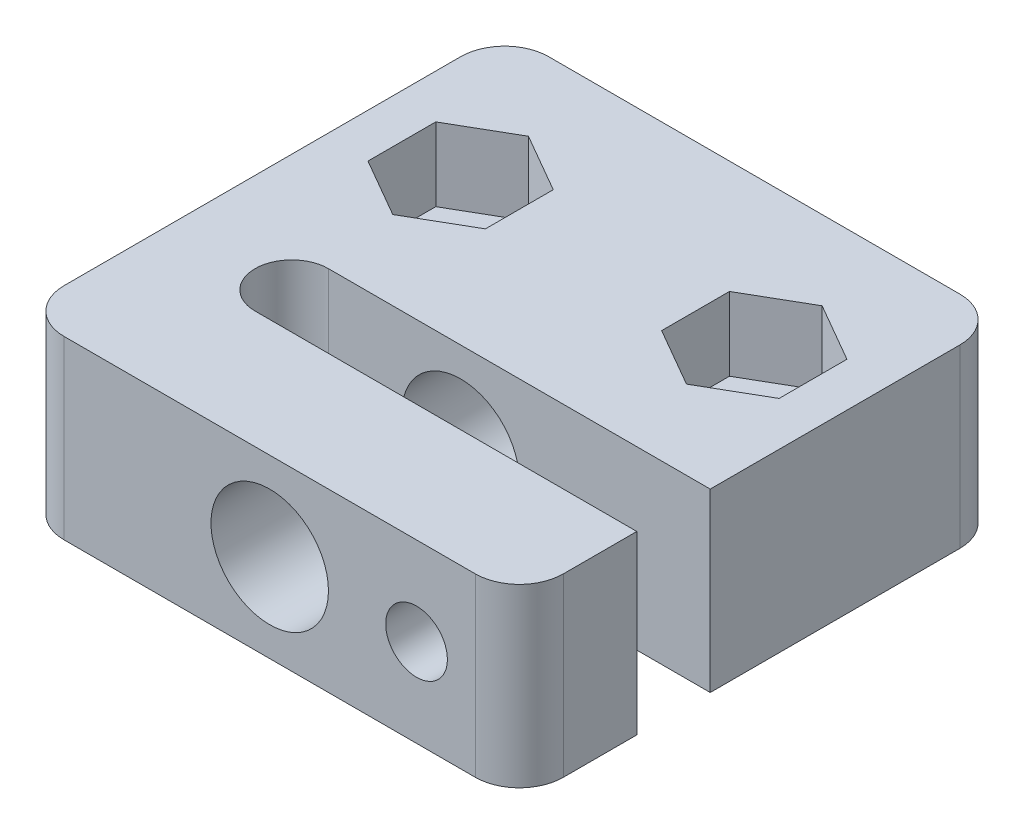
ISO-10303-21;
HEADER;
FILE_DESCRIPTION(('STEP AP214'),'2;1');
FILE_NAME('part.step','',(''),(''),'','','');
FILE_SCHEMA(('AUTOMOTIVE_DESIGN { 1 0 10303 214 1 1 1 1 }'));
ENDSEC;
DATA;
#1=APPLICATION_CONTEXT('core data for automotive mechanical design processes');
#2=APPLICATION_PROTOCOL_DEFINITION('international standard','automotive_design',2000,#1);
#3=PRODUCT_CONTEXT('',#1,'mechanical');
#4=PRODUCT('Part','Part','',(#3));
#5=PRODUCT_RELATED_PRODUCT_CATEGORY('part','',(#4));
#6=PRODUCT_DEFINITION_FORMATION('','',#4);
#7=PRODUCT_DEFINITION_CONTEXT('part definition',#1,'design');
#8=PRODUCT_DEFINITION('design','',#6,#7);
#9=PRODUCT_DEFINITION_SHAPE('','',#8);
#10=(LENGTH_UNIT() NAMED_UNIT(*) SI_UNIT(.MILLI.,.METRE.));
#11=(NAMED_UNIT(*) PLANE_ANGLE_UNIT() SI_UNIT($,.RADIAN.));
#12=(NAMED_UNIT(*) SI_UNIT($,.STERADIAN.) SOLID_ANGLE_UNIT());
#13=UNCERTAINTY_MEASURE_WITH_UNIT(LENGTH_MEASURE(1.E-05),#10,'distance_accuracy_value','');
#14=(GEOMETRIC_REPRESENTATION_CONTEXT(3) GLOBAL_UNCERTAINTY_ASSIGNED_CONTEXT((#13)) GLOBAL_UNIT_ASSIGNED_CONTEXT((#10,
#11,#12)) REPRESENTATION_CONTEXT('',''));
#15=CARTESIAN_POINT('',(0.,0.,0.));
#16=DIRECTION('',(0.,0.,1.));
#17=DIRECTION('',(1.,0.,0.));
#18=AXIS2_PLACEMENT_3D('',#15,#16,#17);
#19=CARTESIAN_POINT('',(17.,-6.,33.));
#20=DIRECTION('',(-1.,0.,0.));
#21=DIRECTION('',(0.,0.,1.));
#22=AXIS2_PLACEMENT_3D('',#19,#20,#21);
#23=PLANE('',#22);
#24=DIRECTION('',(0.,0.,-1.));
#25=VECTOR('',#24,1.);
#26=CARTESIAN_POINT('',(17.,6.,33.));
#27=LINE('',#26,#25);
#28=CARTESIAN_POINT('',(17.,6.,30.));
#29=VERTEX_POINT('',#28);
#30=CARTESIAN_POINT('',(17.,6.,25.));
#31=VERTEX_POINT('',#30);
#32=EDGE_CURVE('E247',#29,#31,#27,.T.);
#33=ORIENTED_EDGE('',*,*,#32,.F.);
#34=DIRECTION('',(0.,1.,0.));
#35=VECTOR('',#34,1.);
#36=CARTESIAN_POINT('',(17.,-6.,30.));
#37=LINE('',#36,#35);
#38=CARTESIAN_POINT('',(17.,-6.,30.));
#39=VERTEX_POINT('',#38);
#40=EDGE_CURVE('E11',#29,#39,#37,.F.);
#41=ORIENTED_EDGE('',*,*,#40,.T.);
#42=DIRECTION('',(0.,0.,-1.));
#43=VECTOR('',#42,1.);
#44=CARTESIAN_POINT('',(17.,-6.,33.));
#45=LINE('',#44,#43);
#46=CARTESIAN_POINT('',(17.,-6.,25.));
#47=VERTEX_POINT('',#46);
#48=EDGE_CURVE('E246',#39,#47,#45,.T.);
#49=ORIENTED_EDGE('',*,*,#48,.T.);
#50=DIRECTION('',(0.,1.,0.));
#51=VECTOR('',#50,1.);
#52=CARTESIAN_POINT('',(17.,-6.,25.));
#53=LINE('',#52,#51);
#54=EDGE_CURVE('E284',#47,#31,#53,.T.);
#55=ORIENTED_EDGE('',*,*,#54,.T.);
#56=EDGE_LOOP('',(#33,#41,#49,#55));
#57=FACE_BOUND('',#56,.T.);
#58=ADVANCED_FACE('F38',(#57),#23,.F.);
#59=CARTESIAN_POINT('',(0.,0.,0.));
#60=DIRECTION('',(0.,0.,1.));
#61=DIRECTION('',(1.,0.,0.));
#62=AXIS2_PLACEMENT_3D('',#59,#60,#61);
#63=CYLINDRICAL_SURFACE('',#62,4.);
#64=CARTESIAN_POINT('',(0.,0.,25.));
#65=DIRECTION('',(0.,0.,1.));
#66=DIRECTION('',(1.,0.,0.));
#67=AXIS2_PLACEMENT_3D('',#64,#65,#66);
#68=CIRCLE('',#67,4.);
#69=CARTESIAN_POINT('',(4.,0.,25.));
#70=VERTEX_POINT('',#69);
#71=EDGE_CURVE('E283',#70,#70,#68,.F.);
#72=ORIENTED_EDGE('',*,*,#71,.T.);
#73=EDGE_LOOP('',(#72));
#74=FACE_BOUND('',#73,.T.);
#75=CARTESIAN_POINT('',(0.,0.,33.));
#76=DIRECTION('',(0.,0.,1.));
#77=DIRECTION('',(1.,0.,0.));
#78=AXIS2_PLACEMENT_3D('',#75,#76,#77);
#79=CIRCLE('',#78,4.);
#80=CARTESIAN_POINT('',(4.,0.,33.));
#81=VERTEX_POINT('',#80);
#82=EDGE_CURVE('E261',#81,#81,#79,.T.);
#83=ORIENTED_EDGE('',*,*,#82,.T.);
#84=EDGE_LOOP('',(#83));
#85=FACE_BOUND('',#84,.T.);
#86=ADVANCED_FACE('F366',(#74,#85),#63,.F.);
#87=CARTESIAN_POINT('',(-10.,-6.00000000000001,10.));
#88=DIRECTION('',(0.,1.,0.));
#89=DIRECTION('',(-1.,0.,0.));
#90=AXIS2_PLACEMENT_3D('',#87,#88,#89);
#91=CYLINDRICAL_SURFACE('',#90,2.55);
#92=CARTESIAN_POINT('',(-10.,1.,10.));
#93=DIRECTION('',(0.,1.,0.));
#94=DIRECTION('',(0.,0.,1.));
#95=AXIS2_PLACEMENT_3D('',#92,#93,#94);
#96=CIRCLE('',#95,2.55);
#97=CARTESIAN_POINT('',(-10.,1.,12.55));
#98=VERTEX_POINT('',#97);
#99=EDGE_CURVE('E258',#98,#98,#96,.F.);
#100=ORIENTED_EDGE('',*,*,#99,.F.);
#101=EDGE_LOOP('',(#100));
#102=FACE_BOUND('',#101,.T.);
#103=CARTESIAN_POINT('',(-10.,-4.,10.));
#104=DIRECTION('',(0.,-1.,0.));
#105=DIRECTION('',(1.,0.,0.));
#106=AXIS2_PLACEMENT_3D('',#103,#104,#105);
#107=CIRCLE('',#106,2.55);
#108=CARTESIAN_POINT('',(-7.45,-4.,10.));
#109=VERTEX_POINT('',#108);
#110=EDGE_CURVE('E275',#109,#109,#107,.F.);
#111=ORIENTED_EDGE('',*,*,#110,.F.);
#112=EDGE_LOOP('',(#111));
#113=FACE_BOUND('',#112,.T.);
#114=ADVANCED_FACE('F372',(#102,#113),#91,.F.);
#115=CARTESIAN_POINT('',(10.,-6.00000000000001,10.));
#116=DIRECTION('',(0.,1.,0.));
#117=DIRECTION('',(-1.,0.,0.));
#118=AXIS2_PLACEMENT_3D('',#115,#116,#117);
#119=CYLINDRICAL_SURFACE('',#118,2.55);
#120=CARTESIAN_POINT('',(10.,1.,10.));
#121=DIRECTION('',(0.,-1.,0.));
#122=DIRECTION('',(1.,0.,0.));
#123=AXIS2_PLACEMENT_3D('',#120,#121,#122);
#124=CIRCLE('',#123,2.55);
#125=CARTESIAN_POINT('',(12.55,1.,10.));
#126=VERTEX_POINT('',#125);
#127=EDGE_CURVE('E263',#126,#126,#124,.F.);
#128=ORIENTED_EDGE('',*,*,#127,.T.);
#129=EDGE_LOOP('',(#128));
#130=FACE_BOUND('',#129,.T.);
#131=CARTESIAN_POINT('',(10.,-4.,10.));
#132=DIRECTION('',(0.,-1.,0.));
#133=DIRECTION('',(1.,0.,0.));
#134=AXIS2_PLACEMENT_3D('',#131,#132,#133);
#135=CIRCLE('',#134,2.55);
#136=CARTESIAN_POINT('',(12.55,-4.,10.));
#137=VERTEX_POINT('',#136);
#138=EDGE_CURVE('E269',#137,#137,#135,.F.);
#139=ORIENTED_EDGE('',*,*,#138,.F.);
#140=EDGE_LOOP('',(#139));
#141=FACE_BOUND('',#140,.T.);
#142=ADVANCED_FACE('F388',(#130,#141),#119,.F.);
#143=CARTESIAN_POINT('',(-17.,-6.,33.));
#144=DIRECTION('',(1.,0.,0.));
#145=DIRECTION('',(0.,0.,-1.));
#146=AXIS2_PLACEMENT_3D('',#143,#144,#145);
#147=PLANE('',#146);
#148=DIRECTION('',(0.,0.,-1.));
#149=VECTOR('',#148,1.);
#150=CARTESIAN_POINT('',(-17.,6.,33.));
#151=LINE('',#150,#149);
#152=CARTESIAN_POINT('',(-17.,6.,30.));
#153=VERTEX_POINT('',#152);
#154=CARTESIAN_POINT('',(-17.,6.,3.));
#155=VERTEX_POINT('',#154);
#156=EDGE_CURVE('E330',#153,#155,#151,.T.);
#157=ORIENTED_EDGE('',*,*,#156,.T.);
#158=DIRECTION('',(0.,-1.,0.));
#159=VECTOR('',#158,1.);
#160=CARTESIAN_POINT('',(-17.,-6.,3.));
#161=LINE('',#160,#159);
#162=CARTESIAN_POINT('',(-17.,-6.,3.));
#163=VERTEX_POINT('',#162);
#164=EDGE_CURVE('E289',#155,#163,#161,.T.);
#165=ORIENTED_EDGE('',*,*,#164,.T.);
#166=DIRECTION('',(0.,0.,-1.));
#167=VECTOR('',#166,1.);
#168=CARTESIAN_POINT('',(-17.,-6.,33.));
#169=LINE('',#168,#167);
#170=CARTESIAN_POINT('',(-17.,-6.,30.));
#171=VERTEX_POINT('',#170);
#172=EDGE_CURVE('E251',#171,#163,#169,.T.);
#173=ORIENTED_EDGE('',*,*,#172,.F.);
#174=DIRECTION('',(0.,-1.,0.));
#175=VECTOR('',#174,1.);
#176=CARTESIAN_POINT('',(-17.,6.,30.));
#177=LINE('',#176,#175);
#178=EDGE_CURVE('E257',#171,#153,#177,.F.);
#179=ORIENTED_EDGE('',*,*,#178,.T.);
#180=EDGE_LOOP('',(#157,#165,#173,#179));
#181=FACE_BOUND('',#180,.T.);
#182=ADVANCED_FACE('F355',(#181),#147,.F.);
#183=CARTESIAN_POINT('',(17.,-6.,33.));
#184=DIRECTION('',(0.,1.,0.));
#185=DIRECTION('',(-1.,0.,0.));
#186=AXIS2_PLACEMENT_3D('',#183,#184,#185);
#187=PLANE('',#186);
#188=CARTESIAN_POINT('',(-10.,-6.,10.));
#189=DIRECTION('',(0.,-1.,0.));
#190=DIRECTION('',(1.,0.,0.));
#191=AXIS2_PLACEMENT_3D('',#188,#189,#190);
#192=CIRCLE('',#191,4.5);
#193=CARTESIAN_POINT('',(-5.5,-6.,10.));
#194=VERTEX_POINT('',#193);
#195=EDGE_CURVE('E287',#194,#194,#192,.T.);
#196=ORIENTED_EDGE('',*,*,#195,.F.);
#197=EDGE_LOOP('',(#196));
#198=FACE_BOUND('',#197,.T.);
#199=CARTESIAN_POINT('',(10.,-6.,10.));
#200=DIRECTION('',(0.,-1.,0.));
#201=DIRECTION('',(1.,0.,0.));
#202=AXIS2_PLACEMENT_3D('',#199,#200,#201);
#203=CIRCLE('',#202,4.5);
#204=CARTESIAN_POINT('',(14.5,-6.,10.));
#205=VERTEX_POINT('',#204);
#206=EDGE_CURVE('E278',#205,#205,#203,.T.);
#207=ORIENTED_EDGE('',*,*,#206,.F.);
#208=EDGE_LOOP('',(#207));
#209=FACE_BOUND('',#208,.T.);
#210=ORIENTED_EDGE('',*,*,#172,.T.);
#211=CARTESIAN_POINT('',(-14.,-6.,3.));
#212=DIRECTION('',(0.,1.,0.));
#213=DIRECTION('',(-1.,0.,0.));
#214=AXIS2_PLACEMENT_3D('',#211,#212,#213);
#215=CIRCLE('',#214,3.);
#216=CARTESIAN_POINT('',(-14.,-6.,0.));
#217=VERTEX_POINT('',#216);
#218=EDGE_CURVE('E298',#163,#217,#215,.F.);
#219=ORIENTED_EDGE('',*,*,#218,.T.);
#220=DIRECTION('',(1.,0.,0.));
#221=VECTOR('',#220,1.);
#222=CARTESIAN_POINT('',(17.,-6.,0.));
#223=LINE('',#222,#221);
#224=CARTESIAN_POINT('',(14.,-6.,0.));
#225=VERTEX_POINT('',#224);
#226=EDGE_CURVE('E338',#217,#225,#223,.T.);
#227=ORIENTED_EDGE('',*,*,#226,.T.);
#228=CARTESIAN_POINT('',(14.,-6.,3.));
#229=DIRECTION('',(0.,1.,0.));
#230=DIRECTION('',(-1.,0.,0.));
#231=AXIS2_PLACEMENT_3D('',#228,#229,#230);
#232=CIRCLE('',#231,3.);
#233=CARTESIAN_POINT('',(17.,-6.,3.));
#234=VERTEX_POINT('',#233);
#235=EDGE_CURVE('E244',#225,#234,#232,.F.);
#236=ORIENTED_EDGE('',*,*,#235,.T.);
#237=CARTESIAN_POINT('',(17.,-6.,20.));
#238=VERTEX_POINT('',#237);
#239=EDGE_CURVE('E233',#238,#234,#45,.T.);
#240=ORIENTED_EDGE('',*,*,#239,.F.);
#241=DIRECTION('',(-1.,0.,0.));
#242=VECTOR('',#241,1.);
#243=CARTESIAN_POINT('',(17.,-6.,20.));
#244=LINE('',#243,#242);
#245=CARTESIAN_POINT('',(-9.,-6.00000000000001,20.));
#246=VERTEX_POINT('',#245);
#247=EDGE_CURVE('E213',#238,#246,#244,.T.);
#248=ORIENTED_EDGE('',*,*,#247,.T.);
#249=CARTESIAN_POINT('',(-9.,-6.00000000000001,22.5));
#250=DIRECTION('',(0.,1.,0.));
#251=DIRECTION('',(-1.,0.,0.));
#252=AXIS2_PLACEMENT_3D('',#249,#250,#251);
#253=CIRCLE('',#252,2.5);
#254=CARTESIAN_POINT('',(-9.,-6.00000000000001,25.));
#255=VERTEX_POINT('',#254);
#256=EDGE_CURVE('E225',#246,#255,#253,.T.);
#257=ORIENTED_EDGE('',*,*,#256,.T.);
#258=DIRECTION('',(1.,0.,0.));
#259=VECTOR('',#258,1.);
#260=CARTESIAN_POINT('',(17.,-6.,25.));
#261=LINE('',#260,#259);
#262=EDGE_CURVE('E238',#255,#47,#261,.T.);
#263=ORIENTED_EDGE('',*,*,#262,.T.);
#264=ORIENTED_EDGE('',*,*,#48,.F.);
#265=CARTESIAN_POINT('',(14.,-6.,30.));
#266=DIRECTION('',(0.,1.,0.));
#267=DIRECTION('',(-1.,0.,0.));
#268=AXIS2_PLACEMENT_3D('',#265,#266,#267);
#269=CIRCLE('',#268,3.);
#270=CARTESIAN_POINT('',(14.,-6.,33.));
#271=VERTEX_POINT('',#270);
#272=EDGE_CURVE('E295',#39,#271,#269,.F.);
#273=ORIENTED_EDGE('',*,*,#272,.T.);
#274=DIRECTION('',(1.,0.,0.));
#275=VECTOR('',#274,1.);
#276=CARTESIAN_POINT('',(17.,-6.,33.));
#277=LINE('',#276,#275);
#278=CARTESIAN_POINT('',(-14.,-6.,33.));
#279=VERTEX_POINT('',#278);
#280=EDGE_CURVE('E325',#279,#271,#277,.T.);
#281=ORIENTED_EDGE('',*,*,#280,.F.);
#282=CARTESIAN_POINT('',(-14.,-6.,30.));
#283=DIRECTION('',(0.,1.,0.));
#284=DIRECTION('',(-1.,0.,0.));
#285=AXIS2_PLACEMENT_3D('',#282,#283,#284);
#286=CIRCLE('',#285,3.);
#287=EDGE_CURVE('E293',#279,#171,#286,.F.);
#288=ORIENTED_EDGE('',*,*,#287,.T.);
#289=EDGE_LOOP('',(#210,#219,#227,#236,#240,#248,#257,#263,#264,#273,#281,#288));
#290=FACE_BOUND('',#289,.T.);
#291=ADVANCED_FACE('F241',(#198,#209,#290),#187,.F.);
#292=ORIENTED_EDGE('',*,*,#239,.T.);
#293=DIRECTION('',(0.,1.,0.));
#294=VECTOR('',#293,1.);
#295=CARTESIAN_POINT('',(17.,-6.,3.));
#296=LINE('',#295,#294);
#297=CARTESIAN_POINT('',(17.,6.,3.));
#298=VERTEX_POINT('',#297);
#299=EDGE_CURVE('E315',#234,#298,#296,.T.);
#300=ORIENTED_EDGE('',*,*,#299,.T.);
#301=CARTESIAN_POINT('',(17.,6.,20.));
#302=VERTEX_POINT('',#301);
#303=EDGE_CURVE('E236',#302,#298,#27,.T.);
#304=ORIENTED_EDGE('',*,*,#303,.F.);
#305=DIRECTION('',(0.,1.,0.));
#306=VECTOR('',#305,1.);
#307=CARTESIAN_POINT('',(17.,-6.,20.));
#308=LINE('',#307,#306);
#309=EDGE_CURVE('E218',#238,#302,#308,.T.);
#310=ORIENTED_EDGE('',*,*,#309,.F.);
#311=EDGE_LOOP('',(#292,#300,#304,#310));
#312=FACE_BOUND('',#311,.T.);
#313=ADVANCED_FACE('F231',(#312),#23,.F.);
#314=CARTESIAN_POINT('',(17.,6.,33.));
#315=DIRECTION('',(0.,-1.,0.));
#316=DIRECTION('',(1.,0.,0.));
#317=AXIS2_PLACEMENT_3D('',#314,#315,#316);
#318=PLANE('',#317);
#319=DIRECTION('',(0.866025403784438,0.,0.5));
#320=VECTOR('',#319,1.);
#321=CARTESIAN_POINT('',(10.,6.,14.618802153517));
#322=LINE('',#321,#320);
#323=CARTESIAN_POINT('',(6.00000000000001,6.,12.3094010767585));
#324=VERTEX_POINT('',#323);
#325=CARTESIAN_POINT('',(10.,6.,14.618802153517));
#326=VERTEX_POINT('',#325);
#327=EDGE_CURVE('E610',#324,#326,#322,.T.);
#328=ORIENTED_EDGE('',*,*,#327,.F.);
#329=DIRECTION('',(0.,0.,1.));
#330=VECTOR('',#329,1.);
#331=CARTESIAN_POINT('',(6.00000000000001,6.,12.3094010767585));
#332=LINE('',#331,#330);
#333=CARTESIAN_POINT('',(6.,6.,7.6905989232415));
#334=VERTEX_POINT('',#333);
#335=EDGE_CURVE('E273',#334,#324,#332,.T.);
#336=ORIENTED_EDGE('',*,*,#335,.F.);
#337=DIRECTION('',(-0.866025403784439,0.,0.5));
#338=VECTOR('',#337,1.);
#339=CARTESIAN_POINT('',(6.,6.,7.6905989232415));
#340=LINE('',#339,#338);
#341=CARTESIAN_POINT('',(10.,6.,5.381197846483));
#342=VERTEX_POINT('',#341);
#343=EDGE_CURVE('E589',#342,#334,#340,.T.);
#344=ORIENTED_EDGE('',*,*,#343,.F.);
#345=DIRECTION('',(-0.866025403784439,0.,-0.5));
#346=VECTOR('',#345,1.);
#347=CARTESIAN_POINT('',(10.,6.,5.381197846483));
#348=LINE('',#347,#346);
#349=CARTESIAN_POINT('',(14.,6.,7.6905989232415));
#350=VERTEX_POINT('',#349);
#351=EDGE_CURVE('E621',#350,#342,#348,.T.);
#352=ORIENTED_EDGE('',*,*,#351,.F.);
#353=DIRECTION('',(0.,0.,-1.));
#354=VECTOR('',#353,1.);
#355=CARTESIAN_POINT('',(14.,6.,7.6905989232415));
#356=LINE('',#355,#354);
#357=CARTESIAN_POINT('',(14.,6.,12.3094010767585));
#358=VERTEX_POINT('',#357);
#359=EDGE_CURVE('E618',#358,#350,#356,.T.);
#360=ORIENTED_EDGE('',*,*,#359,.F.);
#361=DIRECTION('',(0.866025403784439,0.,-0.5));
#362=VECTOR('',#361,1.);
#363=CARTESIAN_POINT('',(14.,6.,12.3094010767585));
#364=LINE('',#363,#362);
#365=EDGE_CURVE('E614',#326,#358,#364,.T.);
#366=ORIENTED_EDGE('',*,*,#365,.F.);
#367=EDGE_LOOP('',(#328,#336,#344,#352,#360,#366));
#368=FACE_BOUND('',#367,.T.);
#369=DIRECTION('',(-0.866025403784439,0.,0.5));
#370=VECTOR('',#369,1.);
#371=CARTESIAN_POINT('',(-10.,6.,5.381197846483));
#372=LINE('',#371,#370);
#373=CARTESIAN_POINT('',(-10.,6.,5.381197846483));
#374=VERTEX_POINT('',#373);
#375=CARTESIAN_POINT('',(-14.,6.,7.6905989232415));
#376=VERTEX_POINT('',#375);
#377=EDGE_CURVE('E405',#374,#376,#372,.T.);
#378=ORIENTED_EDGE('',*,*,#377,.F.);
#379=DIRECTION('',(-0.866025403784439,0.,-0.5));
#380=VECTOR('',#379,1.);
#381=CARTESIAN_POINT('',(-6.00000000000001,6.,7.6905989232415));
#382=LINE('',#381,#380);
#383=CARTESIAN_POINT('',(-6.00000000000001,6.,7.6905989232415));
#384=VERTEX_POINT('',#383);
#385=EDGE_CURVE('E267',#384,#374,#382,.T.);
#386=ORIENTED_EDGE('',*,*,#385,.F.);
#387=DIRECTION('',(0.,0.,-1.));
#388=VECTOR('',#387,1.);
#389=CARTESIAN_POINT('',(-6.00000000000001,6.,12.3094010767585));
#390=LINE('',#389,#388);
#391=CARTESIAN_POINT('',(-6.00000000000001,6.,12.3094010767585));
#392=VERTEX_POINT('',#391);
#393=EDGE_CURVE('E425',#392,#384,#390,.T.);
#394=ORIENTED_EDGE('',*,*,#393,.F.);
#395=DIRECTION('',(0.866025403784438,0.,-0.5));
#396=VECTOR('',#395,1.);
#397=CARTESIAN_POINT('',(-10.,6.,14.618802153517));
#398=LINE('',#397,#396);
#399=CARTESIAN_POINT('',(-10.,6.,14.618802153517));
#400=VERTEX_POINT('',#399);
#401=EDGE_CURVE('E422',#400,#392,#398,.T.);
#402=ORIENTED_EDGE('',*,*,#401,.F.);
#403=DIRECTION('',(0.866025403784439,0.,0.5));
#404=VECTOR('',#403,1.);
#405=CARTESIAN_POINT('',(-14.,6.,12.3094010767585));
#406=LINE('',#405,#404);
#407=CARTESIAN_POINT('',(-14.,6.,12.3094010767585));
#408=VERTEX_POINT('',#407);
#409=EDGE_CURVE('E419',#408,#400,#406,.T.);
#410=ORIENTED_EDGE('',*,*,#409,.F.);
#411=DIRECTION('',(0.,0.,1.));
#412=VECTOR('',#411,1.);
#413=CARTESIAN_POINT('',(-14.,6.,7.6905989232415));
#414=LINE('',#413,#412);
#415=EDGE_CURVE('E407',#376,#408,#414,.T.);
#416=ORIENTED_EDGE('',*,*,#415,.F.);
#417=EDGE_LOOP('',(#378,#386,#394,#402,#410,#416));
#418=FACE_BOUND('',#417,.T.);
#419=DIRECTION('',(-1.,0.,0.));
#420=VECTOR('',#419,1.);
#421=CARTESIAN_POINT('',(17.,6.,0.));
#422=LINE('',#421,#420);
#423=CARTESIAN_POINT('',(14.,6.,0.));
#424=VERTEX_POINT('',#423);
#425=CARTESIAN_POINT('',(-14.,6.,0.));
#426=VERTEX_POINT('',#425);
#427=EDGE_CURVE('E334',#424,#426,#422,.T.);
#428=ORIENTED_EDGE('',*,*,#427,.T.);
#429=CARTESIAN_POINT('',(-14.,6.,3.));
#430=DIRECTION('',(0.,-1.,0.));
#431=DIRECTION('',(1.,0.,0.));
#432=AXIS2_PLACEMENT_3D('',#429,#430,#431);
#433=CIRCLE('',#432,3.);
#434=EDGE_CURVE('E312',#426,#155,#433,.F.);
#435=ORIENTED_EDGE('',*,*,#434,.T.);
#436=ORIENTED_EDGE('',*,*,#156,.F.);
#437=CARTESIAN_POINT('',(-14.,6.,30.));
#438=DIRECTION('',(0.,-1.,0.));
#439=DIRECTION('',(1.,0.,0.));
#440=AXIS2_PLACEMENT_3D('',#437,#438,#439);
#441=CIRCLE('',#440,3.);
#442=CARTESIAN_POINT('',(-14.,6.,33.));
#443=VERTEX_POINT('',#442);
#444=EDGE_CURVE('E53',#153,#443,#441,.F.);
#445=ORIENTED_EDGE('',*,*,#444,.T.);
#446=DIRECTION('',(-1.,0.,0.));
#447=VECTOR('',#446,1.);
#448=CARTESIAN_POINT('',(17.,6.,33.));
#449=LINE('',#448,#447);
#450=CARTESIAN_POINT('',(14.,6.,33.));
#451=VERTEX_POINT('',#450);
#452=EDGE_CURVE('E322',#451,#443,#449,.T.);
#453=ORIENTED_EDGE('',*,*,#452,.F.);
#454=CARTESIAN_POINT('',(14.,6.,30.));
#455=DIRECTION('',(0.,-1.,0.));
#456=DIRECTION('',(1.,0.,0.));
#457=AXIS2_PLACEMENT_3D('',#454,#455,#456);
#458=CIRCLE('',#457,3.);
#459=EDGE_CURVE('E61',#451,#29,#458,.F.);
#460=ORIENTED_EDGE('',*,*,#459,.T.);
#461=ORIENTED_EDGE('',*,*,#32,.T.);
#462=DIRECTION('',(1.,0.,0.));
#463=VECTOR('',#462,1.);
#464=CARTESIAN_POINT('',(17.,6.,25.));
#465=LINE('',#464,#463);
#466=CARTESIAN_POINT('',(-9.,6.,25.));
#467=VERTEX_POINT('',#466);
#468=EDGE_CURVE('E226',#467,#31,#465,.T.);
#469=ORIENTED_EDGE('',*,*,#468,.F.);
#470=CARTESIAN_POINT('',(-9.,6.,22.5));
#471=DIRECTION('',(0.,1.,0.));
#472=DIRECTION('',(-1.,0.,0.));
#473=AXIS2_PLACEMENT_3D('',#470,#471,#472);
#474=CIRCLE('',#473,2.5);
#475=CARTESIAN_POINT('',(-9.,6.,20.));
#476=VERTEX_POINT('',#475);
#477=EDGE_CURVE('E564',#476,#467,#474,.T.);
#478=ORIENTED_EDGE('',*,*,#477,.F.);
#479=DIRECTION('',(-1.,0.,0.));
#480=VECTOR('',#479,1.);
#481=CARTESIAN_POINT('',(17.,6.,20.));
#482=LINE('',#481,#480);
#483=EDGE_CURVE('E401',#302,#476,#482,.T.);
#484=ORIENTED_EDGE('',*,*,#483,.F.);
#485=ORIENTED_EDGE('',*,*,#303,.T.);
#486=CARTESIAN_POINT('',(14.,6.,3.));
#487=DIRECTION('',(0.,-1.,0.));
#488=DIRECTION('',(1.,0.,0.));
#489=AXIS2_PLACEMENT_3D('',#486,#487,#488);
#490=CIRCLE('',#489,3.);
#491=EDGE_CURVE('E309',#298,#424,#490,.F.);
#492=ORIENTED_EDGE('',*,*,#491,.T.);
#493=EDGE_LOOP('',(#428,#435,#436,#445,#453,#460,#461,#469,#478,#484,#485,#492));
#494=FACE_BOUND('',#493,.T.);
#495=ADVANCED_FACE('F328',(#368,#418,#494),#318,.F.);
#496=CARTESIAN_POINT('',(0.,0.,33.));
#497=DIRECTION('',(0.,0.,1.));
#498=DIRECTION('',(1.,0.,0.));
#499=AXIS2_PLACEMENT_3D('',#496,#497,#498);
#500=PLANE('',#499);
#501=CARTESIAN_POINT('',(10.,0.,33.));
#502=DIRECTION('',(0.,0.,1.));
#503=DIRECTION('',(1.,0.,0.));
#504=AXIS2_PLACEMENT_3D('',#501,#502,#503);
#505=CIRCLE('',#504,2.09999999999999);
#506=CARTESIAN_POINT('',(12.1,0.,33.));
#507=VERTEX_POINT('',#506);
#508=EDGE_CURVE('E555',#507,#507,#505,.T.);
#509=ORIENTED_EDGE('',*,*,#508,.F.);
#510=EDGE_LOOP('',(#509));
#511=FACE_BOUND('',#510,.T.);
#512=ORIENTED_EDGE('',*,*,#82,.F.);
#513=EDGE_LOOP('',(#512));
#514=FACE_BOUND('',#513,.T.);
#515=ORIENTED_EDGE('',*,*,#280,.T.);
#516=DIRECTION('',(0.,1.,0.));
#517=VECTOR('',#516,1.);
#518=CARTESIAN_POINT('',(14.,6.,33.));
#519=LINE('',#518,#517);
#520=EDGE_CURVE('E46',#271,#451,#519,.T.);
#521=ORIENTED_EDGE('',*,*,#520,.T.);
#522=ORIENTED_EDGE('',*,*,#452,.T.);
#523=DIRECTION('',(0.,-1.,0.));
#524=VECTOR('',#523,1.);
#525=CARTESIAN_POINT('',(-14.,-6.,33.));
#526=LINE('',#525,#524);
#527=EDGE_CURVE('E317',#443,#279,#526,.T.);
#528=ORIENTED_EDGE('',*,*,#527,.T.);
#529=EDGE_LOOP('',(#515,#521,#522,#528));
#530=FACE_BOUND('',#529,.T.);
#531=ADVANCED_FACE('F321',(#511,#514,#530),#500,.T.);
#532=CARTESIAN_POINT('',(0.,0.,0.));
#533=DIRECTION('',(0.,0.,1.));
#534=DIRECTION('',(1.,0.,0.));
#535=AXIS2_PLACEMENT_3D('',#532,#533,#534);
#536=PLANE('',#535);
#537=CARTESIAN_POINT('',(0.,0.,0.));
#538=DIRECTION('',(0.,0.,1.));
#539=DIRECTION('',(1.,0.,0.));
#540=AXIS2_PLACEMENT_3D('',#537,#538,#539);
#541=CIRCLE('',#540,4.);
#542=CARTESIAN_POINT('',(4.,0.,0.));
#543=VERTEX_POINT('',#542);
#544=EDGE_CURVE('E341',#543,#543,#541,.T.);
#545=ORIENTED_EDGE('',*,*,#544,.T.);
#546=EDGE_LOOP('',(#545));
#547=FACE_BOUND('',#546,.T.);
#548=ORIENTED_EDGE('',*,*,#226,.F.);
#549=DIRECTION('',(0.,-1.,0.));
#550=VECTOR('',#549,1.);
#551=CARTESIAN_POINT('',(-14.,0.,0.));
#552=LINE('',#551,#550);
#553=EDGE_CURVE('E304',#217,#426,#552,.F.);
#554=ORIENTED_EDGE('',*,*,#553,.T.);
#555=ORIENTED_EDGE('',*,*,#427,.F.);
#556=DIRECTION('',(0.,1.,0.));
#557=VECTOR('',#556,1.);
#558=CARTESIAN_POINT('',(14.,0.,0.));
#559=LINE('',#558,#557);
#560=EDGE_CURVE('E301',#424,#225,#559,.F.);
#561=ORIENTED_EDGE('',*,*,#560,.T.);
#562=EDGE_LOOP('',(#548,#554,#555,#561));
#563=FACE_BOUND('',#562,.T.);
#564=ADVANCED_FACE('F447',(#547,#563),#536,.F.);
#565=CARTESIAN_POINT('',(0.,0.,20.));
#566=DIRECTION('',(0.,0.,-1.));
#567=DIRECTION('',(-1.,0.,0.));
#568=AXIS2_PLACEMENT_3D('',#565,#566,#567);
#569=CIRCLE('',#568,4.);
#570=CARTESIAN_POINT('',(-4.,0.,20.));
#571=VERTEX_POINT('',#570);
#572=EDGE_CURVE('E280',#571,#571,#569,.F.);
#573=ORIENTED_EDGE('',*,*,#572,.T.);
#574=EDGE_LOOP('',(#573));
#575=FACE_BOUND('',#574,.T.);
#576=ORIENTED_EDGE('',*,*,#544,.F.);
#577=EDGE_LOOP('',(#576));
#578=FACE_BOUND('',#577,.T.);
#579=ADVANCED_FACE('F375',(#575,#578),#63,.F.);
#580=CARTESIAN_POINT('',(0.,1.,0.));
#581=DIRECTION('',(0.,1.,0.));
#582=DIRECTION('',(0.,0.,1.));
#583=AXIS2_PLACEMENT_3D('',#580,#581,#582);
#584=PLANE('',#583);
#585=DIRECTION('',(-0.866025403784439,0.,-0.5));
#586=VECTOR('',#585,1.);
#587=CARTESIAN_POINT('',(-6.00000000000001,1.,7.6905989232415));
#588=LINE('',#587,#586);
#589=CARTESIAN_POINT('',(-6.00000000000001,1.,7.6905989232415));
#590=VERTEX_POINT('',#589);
#591=CARTESIAN_POINT('',(-10.,1.,5.381197846483));
#592=VERTEX_POINT('',#591);
#593=EDGE_CURVE('E428',#590,#592,#588,.T.);
#594=ORIENTED_EDGE('',*,*,#593,.T.);
#595=DIRECTION('',(-0.866025403784439,0.,0.5));
#596=VECTOR('',#595,1.);
#597=CARTESIAN_POINT('',(-10.,1.,5.381197846483));
#598=LINE('',#597,#596);
#599=CARTESIAN_POINT('',(-14.,1.,7.6905989232415));
#600=VERTEX_POINT('',#599);
#601=EDGE_CURVE('E643',#592,#600,#598,.T.);
#602=ORIENTED_EDGE('',*,*,#601,.T.);
#603=DIRECTION('',(0.,0.,1.));
#604=VECTOR('',#603,1.);
#605=CARTESIAN_POINT('',(-14.,1.,7.6905989232415));
#606=LINE('',#605,#604);
#607=CARTESIAN_POINT('',(-14.,1.,12.3094010767585));
#608=VERTEX_POINT('',#607);
#609=EDGE_CURVE('E647',#600,#608,#606,.T.);
#610=ORIENTED_EDGE('',*,*,#609,.T.);
#611=DIRECTION('',(0.866025403784439,0.,0.5));
#612=VECTOR('',#611,1.);
#613=CARTESIAN_POINT('',(-14.,1.,12.3094010767585));
#614=LINE('',#613,#612);
#615=CARTESIAN_POINT('',(-10.,1.,14.618802153517));
#616=VERTEX_POINT('',#615);
#617=EDGE_CURVE('E650',#608,#616,#614,.T.);
#618=ORIENTED_EDGE('',*,*,#617,.T.);
#619=DIRECTION('',(0.866025403784438,0.,-0.5));
#620=VECTOR('',#619,1.);
#621=CARTESIAN_POINT('',(-10.,1.,14.618802153517));
#622=LINE('',#621,#620);
#623=CARTESIAN_POINT('',(-6.00000000000001,1.,12.3094010767585));
#624=VERTEX_POINT('',#623);
#625=EDGE_CURVE('E652',#616,#624,#622,.T.);
#626=ORIENTED_EDGE('',*,*,#625,.T.);
#627=DIRECTION('',(0.,0.,-1.));
#628=VECTOR('',#627,1.);
#629=CARTESIAN_POINT('',(-6.00000000000001,1.,12.3094010767585));
#630=LINE('',#629,#628);
#631=EDGE_CURVE('E414',#624,#590,#630,.T.);
#632=ORIENTED_EDGE('',*,*,#631,.T.);
#633=EDGE_LOOP('',(#594,#602,#610,#618,#626,#632));
#634=FACE_BOUND('',#633,.T.);
#635=ORIENTED_EDGE('',*,*,#99,.T.);
#636=EDGE_LOOP('',(#635));
#637=FACE_BOUND('',#636,.T.);
#638=ADVANCED_FACE('F458',(#634,#637),#584,.T.);
#639=CARTESIAN_POINT('',(-6.00000000000001,1.,7.6905989232415));
#640=DIRECTION('',(0.5,0.,-0.866025403784439));
#641=DIRECTION('',(-0.866025403784439,0.,-0.5));
#642=AXIS2_PLACEMENT_3D('',#639,#640,#641);
#643=PLANE('',#642);
#644=ORIENTED_EDGE('',*,*,#385,.T.);
#645=DIRECTION('',(0.,1.,0.));
#646=VECTOR('',#645,1.);
#647=CARTESIAN_POINT('',(-10.,1.,5.381197846483));
#648=LINE('',#647,#646);
#649=EDGE_CURVE('E438',#592,#374,#648,.T.);
#650=ORIENTED_EDGE('',*,*,#649,.F.);
#651=ORIENTED_EDGE('',*,*,#593,.F.);
#652=DIRECTION('',(0.,1.,0.));
#653=VECTOR('',#652,1.);
#654=CARTESIAN_POINT('',(-6.00000000000001,1.,7.6905989232415));
#655=LINE('',#654,#653);
#656=EDGE_CURVE('E262',#590,#384,#655,.T.);
#657=ORIENTED_EDGE('',*,*,#656,.T.);
#658=EDGE_LOOP('',(#644,#650,#651,#657));
#659=FACE_BOUND('',#658,.T.);
#660=ADVANCED_FACE('F466',(#659),#643,.F.);
#661=CARTESIAN_POINT('',(-6.00000000000001,1.,12.3094010767585));
#662=DIRECTION('',(1.,0.,0.));
#663=DIRECTION('',(0.,0.,-1.));
#664=AXIS2_PLACEMENT_3D('',#661,#662,#663);
#665=PLANE('',#664);
#666=ORIENTED_EDGE('',*,*,#393,.T.);
#667=ORIENTED_EDGE('',*,*,#656,.F.);
#668=ORIENTED_EDGE('',*,*,#631,.F.);
#669=DIRECTION('',(0.,1.,0.));
#670=VECTOR('',#669,1.);
#671=CARTESIAN_POINT('',(-6.00000000000001,1.,12.3094010767585));
#672=LINE('',#671,#670);
#673=EDGE_CURVE('E430',#624,#392,#672,.T.);
#674=ORIENTED_EDGE('',*,*,#673,.T.);
#675=EDGE_LOOP('',(#666,#667,#668,#674));
#676=FACE_BOUND('',#675,.T.);
#677=ADVANCED_FACE('F469',(#676),#665,.F.);
#678=CARTESIAN_POINT('',(-10.,1.,14.618802153517));
#679=DIRECTION('',(0.5,0.,0.866025403784438));
#680=DIRECTION('',(0.866025403784438,0.,-0.5));
#681=AXIS2_PLACEMENT_3D('',#678,#679,#680);
#682=PLANE('',#681);
#683=ORIENTED_EDGE('',*,*,#401,.T.);
#684=ORIENTED_EDGE('',*,*,#673,.F.);
#685=ORIENTED_EDGE('',*,*,#625,.F.);
#686=DIRECTION('',(0.,1.,0.));
#687=VECTOR('',#686,1.);
#688=CARTESIAN_POINT('',(-10.,1.,14.618802153517));
#689=LINE('',#688,#687);
#690=EDGE_CURVE('E432',#616,#400,#689,.T.);
#691=ORIENTED_EDGE('',*,*,#690,.T.);
#692=EDGE_LOOP('',(#683,#684,#685,#691));
#693=FACE_BOUND('',#692,.T.);
#694=ADVANCED_FACE('F482',(#693),#682,.F.);
#695=CARTESIAN_POINT('',(-14.,1.,12.3094010767585));
#696=DIRECTION('',(-0.5,0.,0.866025403784438));
#697=DIRECTION('',(0.866025403784439,0.,0.5));
#698=AXIS2_PLACEMENT_3D('',#695,#696,#697);
#699=PLANE('',#698);
#700=ORIENTED_EDGE('',*,*,#409,.T.);
#701=ORIENTED_EDGE('',*,*,#690,.F.);
#702=ORIENTED_EDGE('',*,*,#617,.F.);
#703=DIRECTION('',(0.,1.,0.));
#704=VECTOR('',#703,1.);
#705=CARTESIAN_POINT('',(-14.,1.,12.3094010767585));
#706=LINE('',#705,#704);
#707=EDGE_CURVE('E434',#608,#408,#706,.T.);
#708=ORIENTED_EDGE('',*,*,#707,.T.);
#709=EDGE_LOOP('',(#700,#701,#702,#708));
#710=FACE_BOUND('',#709,.T.);
#711=ADVANCED_FACE('F478',(#710),#699,.F.);
#712=CARTESIAN_POINT('',(-14.,1.,7.6905989232415));
#713=DIRECTION('',(-1.,0.,0.));
#714=DIRECTION('',(0.,-1.,0.));
#715=AXIS2_PLACEMENT_3D('',#712,#713,#714);
#716=PLANE('',#715);
#717=ORIENTED_EDGE('',*,*,#415,.T.);
#718=ORIENTED_EDGE('',*,*,#707,.F.);
#719=ORIENTED_EDGE('',*,*,#609,.F.);
#720=DIRECTION('',(0.,1.,0.));
#721=VECTOR('',#720,1.);
#722=CARTESIAN_POINT('',(-14.,1.,7.6905989232415));
#723=LINE('',#722,#721);
#724=EDGE_CURVE('E436',#600,#376,#723,.T.);
#725=ORIENTED_EDGE('',*,*,#724,.T.);
#726=EDGE_LOOP('',(#717,#718,#719,#725));
#727=FACE_BOUND('',#726,.T.);
#728=ADVANCED_FACE('F474',(#727),#716,.F.);
#729=CARTESIAN_POINT('',(-10.,1.,5.381197846483));
#730=DIRECTION('',(-0.5,0.,-0.866025403784439));
#731=DIRECTION('',(-0.866025403784439,0.,0.5));
#732=AXIS2_PLACEMENT_3D('',#729,#730,#731);
#733=PLANE('',#732);
#734=ORIENTED_EDGE('',*,*,#377,.T.);
#735=ORIENTED_EDGE('',*,*,#724,.F.);
#736=ORIENTED_EDGE('',*,*,#601,.F.);
#737=ORIENTED_EDGE('',*,*,#649,.T.);
#738=EDGE_LOOP('',(#734,#735,#736,#737));
#739=FACE_BOUND('',#738,.T.);
#740=ADVANCED_FACE('F470',(#739),#733,.F.);
#741=CARTESIAN_POINT('',(0.,1.,0.));
#742=DIRECTION('',(0.,-1.,0.));
#743=DIRECTION('',(1.,0.,0.));
#744=AXIS2_PLACEMENT_3D('',#741,#742,#743);
#745=PLANE('',#744);
#746=DIRECTION('',(0.,0.,1.));
#747=VECTOR('',#746,1.);
#748=CARTESIAN_POINT('',(6.00000000000001,1.,12.3094010767585));
#749=LINE('',#748,#747);
#750=CARTESIAN_POINT('',(6.00000000000001,1.,7.6905989232415));
#751=VERTEX_POINT('',#750);
#752=CARTESIAN_POINT('',(6.00000000000001,1.,12.3094010767585));
#753=VERTEX_POINT('',#752);
#754=EDGE_CURVE('E584',#751,#753,#749,.T.);
#755=ORIENTED_EDGE('',*,*,#754,.T.);
#756=DIRECTION('',(0.866025403784438,0.,0.5));
#757=VECTOR('',#756,1.);
#758=CARTESIAN_POINT('',(10.,1.,14.618802153517));
#759=LINE('',#758,#757);
#760=CARTESIAN_POINT('',(10.,1.,14.618802153517));
#761=VERTEX_POINT('',#760);
#762=EDGE_CURVE('E588',#753,#761,#759,.T.);
#763=ORIENTED_EDGE('',*,*,#762,.T.);
#764=DIRECTION('',(0.866025403784439,0.,-0.5));
#765=VECTOR('',#764,1.);
#766=CARTESIAN_POINT('',(14.,1.,12.3094010767585));
#767=LINE('',#766,#765);
#768=CARTESIAN_POINT('',(14.,1.,12.3094010767585));
#769=VERTEX_POINT('',#768);
#770=EDGE_CURVE('E593',#761,#769,#767,.T.);
#771=ORIENTED_EDGE('',*,*,#770,.T.);
#772=DIRECTION('',(0.,0.,-1.));
#773=VECTOR('',#772,1.);
#774=CARTESIAN_POINT('',(14.,1.,7.6905989232415));
#775=LINE('',#774,#773);
#776=CARTESIAN_POINT('',(14.,1.,7.6905989232415));
#777=VERTEX_POINT('',#776);
#778=EDGE_CURVE('E597',#769,#777,#775,.T.);
#779=ORIENTED_EDGE('',*,*,#778,.T.);
#780=DIRECTION('',(-0.866025403784439,0.,-0.5));
#781=VECTOR('',#780,1.);
#782=CARTESIAN_POINT('',(10.,1.,5.381197846483));
#783=LINE('',#782,#781);
#784=CARTESIAN_POINT('',(10.,1.,5.381197846483));
#785=VERTEX_POINT('',#784);
#786=EDGE_CURVE('E600',#777,#785,#783,.T.);
#787=ORIENTED_EDGE('',*,*,#786,.T.);
#788=DIRECTION('',(-0.866025403784439,0.,0.5));
#789=VECTOR('',#788,1.);
#790=CARTESIAN_POINT('',(6.00000000000001,1.,7.6905989232415));
#791=LINE('',#790,#789);
#792=EDGE_CURVE('E603',#785,#751,#791,.T.);
#793=ORIENTED_EDGE('',*,*,#792,.T.);
#794=EDGE_LOOP('',(#755,#763,#771,#779,#787,#793));
#795=FACE_BOUND('',#794,.T.);
#796=ORIENTED_EDGE('',*,*,#127,.F.);
#797=EDGE_LOOP('',(#796));
#798=FACE_BOUND('',#797,.T.);
#799=ADVANCED_FACE('F473',(#795,#798),#745,.F.);
#800=CARTESIAN_POINT('',(6.00000000000001,1.,12.3094010767585));
#801=DIRECTION('',(-1.,0.,0.));
#802=DIRECTION('',(0.,0.,1.));
#803=AXIS2_PLACEMENT_3D('',#800,#801,#802);
#804=PLANE('',#803);
#805=ORIENTED_EDGE('',*,*,#335,.T.);
#806=DIRECTION('',(0.,1.,0.));
#807=VECTOR('',#806,1.);
#808=CARTESIAN_POINT('',(6.00000000000001,1.,12.3094010767585));
#809=LINE('',#808,#807);
#810=EDGE_CURVE('E607',#753,#324,#809,.T.);
#811=ORIENTED_EDGE('',*,*,#810,.F.);
#812=ORIENTED_EDGE('',*,*,#754,.F.);
#813=DIRECTION('',(0.,1.,0.));
#814=VECTOR('',#813,1.);
#815=CARTESIAN_POINT('',(6.00000000000001,1.,7.6905989232415));
#816=LINE('',#815,#814);
#817=EDGE_CURVE('E268',#751,#334,#816,.T.);
#818=ORIENTED_EDGE('',*,*,#817,.T.);
#819=EDGE_LOOP('',(#805,#811,#812,#818));
#820=FACE_BOUND('',#819,.T.);
#821=ADVANCED_FACE('F493',(#820),#804,.F.);
#822=CARTESIAN_POINT('',(6.00000000000001,1.,7.6905989232415));
#823=DIRECTION('',(-0.5,0.,-0.866025403784439));
#824=DIRECTION('',(-0.866025403784439,0.,0.5));
#825=AXIS2_PLACEMENT_3D('',#822,#823,#824);
#826=PLANE('',#825);
#827=ORIENTED_EDGE('',*,*,#343,.T.);
#828=ORIENTED_EDGE('',*,*,#817,.F.);
#829=ORIENTED_EDGE('',*,*,#792,.F.);
#830=DIRECTION('',(0.,1.,0.));
#831=VECTOR('',#830,1.);
#832=CARTESIAN_POINT('',(10.,1.,5.381197846483));
#833=LINE('',#832,#831);
#834=EDGE_CURVE('E628',#785,#342,#833,.T.);
#835=ORIENTED_EDGE('',*,*,#834,.T.);
#836=EDGE_LOOP('',(#827,#828,#829,#835));
#837=FACE_BOUND('',#836,.T.);
#838=ADVANCED_FACE('F496',(#837),#826,.F.);
#839=CARTESIAN_POINT('',(10.,1.,5.381197846483));
#840=DIRECTION('',(0.5,0.,-0.866025403784439));
#841=DIRECTION('',(-0.866025403784439,0.,-0.5));
#842=AXIS2_PLACEMENT_3D('',#839,#840,#841);
#843=PLANE('',#842);
#844=ORIENTED_EDGE('',*,*,#351,.T.);
#845=ORIENTED_EDGE('',*,*,#834,.F.);
#846=ORIENTED_EDGE('',*,*,#786,.F.);
#847=DIRECTION('',(0.,1.,0.));
#848=VECTOR('',#847,1.);
#849=CARTESIAN_POINT('',(14.,1.,7.6905989232415));
#850=LINE('',#849,#848);
#851=EDGE_CURVE('E630',#777,#350,#850,.T.);
#852=ORIENTED_EDGE('',*,*,#851,.T.);
#853=EDGE_LOOP('',(#844,#845,#846,#852));
#854=FACE_BOUND('',#853,.T.);
#855=ADVANCED_FACE('F510',(#854),#843,.F.);
#856=CARTESIAN_POINT('',(14.,1.,7.6905989232415));
#857=DIRECTION('',(1.,0.,0.));
#858=DIRECTION('',(0.,1.,0.));
#859=AXIS2_PLACEMENT_3D('',#856,#857,#858);
#860=PLANE('',#859);
#861=ORIENTED_EDGE('',*,*,#359,.T.);
#862=ORIENTED_EDGE('',*,*,#851,.F.);
#863=ORIENTED_EDGE('',*,*,#778,.F.);
#864=DIRECTION('',(0.,1.,0.));
#865=VECTOR('',#864,1.);
#866=CARTESIAN_POINT('',(14.,1.,12.3094010767585));
#867=LINE('',#866,#865);
#868=EDGE_CURVE('E632',#769,#358,#867,.T.);
#869=ORIENTED_EDGE('',*,*,#868,.T.);
#870=EDGE_LOOP('',(#861,#862,#863,#869));
#871=FACE_BOUND('',#870,.T.);
#872=ADVANCED_FACE('F506',(#871),#860,.F.);
#873=CARTESIAN_POINT('',(14.,1.,12.3094010767585));
#874=DIRECTION('',(0.5,0.,0.866025403784438));
#875=DIRECTION('',(0.866025403784439,0.,-0.5));
#876=AXIS2_PLACEMENT_3D('',#873,#874,#875);
#877=PLANE('',#876);
#878=ORIENTED_EDGE('',*,*,#365,.T.);
#879=ORIENTED_EDGE('',*,*,#868,.F.);
#880=ORIENTED_EDGE('',*,*,#770,.F.);
#881=DIRECTION('',(0.,1.,0.));
#882=VECTOR('',#881,1.);
#883=CARTESIAN_POINT('',(10.,1.,14.618802153517));
#884=LINE('',#883,#882);
#885=EDGE_CURVE('E634',#761,#326,#884,.T.);
#886=ORIENTED_EDGE('',*,*,#885,.T.);
#887=EDGE_LOOP('',(#878,#879,#880,#886));
#888=FACE_BOUND('',#887,.T.);
#889=ADVANCED_FACE('F502',(#888),#877,.F.);
#890=CARTESIAN_POINT('',(10.,1.,14.618802153517));
#891=DIRECTION('',(-0.5,0.,0.866025403784438));
#892=DIRECTION('',(0.866025403784438,0.,0.5));
#893=AXIS2_PLACEMENT_3D('',#890,#891,#892);
#894=PLANE('',#893);
#895=ORIENTED_EDGE('',*,*,#327,.T.);
#896=ORIENTED_EDGE('',*,*,#885,.F.);
#897=ORIENTED_EDGE('',*,*,#762,.F.);
#898=ORIENTED_EDGE('',*,*,#810,.T.);
#899=EDGE_LOOP('',(#895,#896,#897,#898));
#900=FACE_BOUND('',#899,.T.);
#901=ADVANCED_FACE('F498',(#900),#894,.F.);
#902=CARTESIAN_POINT('',(10.,-4.,10.));
#903=DIRECTION('',(0.,-1.,0.));
#904=DIRECTION('',(1.,0.,0.));
#905=AXIS2_PLACEMENT_3D('',#902,#903,#904);
#906=PLANE('',#905);
#907=CARTESIAN_POINT('',(10.,-4.,10.));
#908=DIRECTION('',(0.,-1.,0.));
#909=DIRECTION('',(1.,0.,0.));
#910=AXIS2_PLACEMENT_3D('',#907,#908,#909);
#911=CIRCLE('',#910,4.5);
#912=CARTESIAN_POINT('',(14.5,-4.,10.));
#913=VERTEX_POINT('',#912);
#914=EDGE_CURVE('E274',#913,#913,#911,.T.);
#915=ORIENTED_EDGE('',*,*,#914,.T.);
#916=EDGE_LOOP('',(#915));
#917=FACE_BOUND('',#916,.T.);
#918=ORIENTED_EDGE('',*,*,#138,.T.);
#919=EDGE_LOOP('',(#918));
#920=FACE_BOUND('',#919,.T.);
#921=ADVANCED_FACE('F501',(#917,#920),#906,.T.);
#922=CARTESIAN_POINT('',(10.,-4.,10.));
#923=DIRECTION('',(0.,-1.,0.));
#924=DIRECTION('',(1.,0.,0.));
#925=AXIS2_PLACEMENT_3D('',#922,#923,#924);
#926=CYLINDRICAL_SURFACE('',#925,4.5);
#927=ORIENTED_EDGE('',*,*,#914,.F.);
#928=EDGE_LOOP('',(#927));
#929=FACE_BOUND('',#928,.T.);
#930=ORIENTED_EDGE('',*,*,#206,.T.);
#931=EDGE_LOOP('',(#930));
#932=FACE_BOUND('',#931,.T.);
#933=ADVANCED_FACE('F521',(#929,#932),#926,.F.);
#934=CARTESIAN_POINT('',(-10.,-4.,10.));
#935=DIRECTION('',(0.,-1.,0.));
#936=DIRECTION('',(1.,0.,0.));
#937=AXIS2_PLACEMENT_3D('',#934,#935,#936);
#938=PLANE('',#937);
#939=CARTESIAN_POINT('',(-10.,-4.,10.));
#940=DIRECTION('',(0.,-1.,0.));
#941=DIRECTION('',(1.,0.,0.));
#942=AXIS2_PLACEMENT_3D('',#939,#940,#941);
#943=CIRCLE('',#942,4.5);
#944=CARTESIAN_POINT('',(-5.5,-4.,10.));
#945=VERTEX_POINT('',#944);
#946=EDGE_CURVE('E279',#945,#945,#943,.T.);
#947=ORIENTED_EDGE('',*,*,#946,.T.);
#948=EDGE_LOOP('',(#947));
#949=FACE_BOUND('',#948,.T.);
#950=ORIENTED_EDGE('',*,*,#110,.T.);
#951=EDGE_LOOP('',(#950));
#952=FACE_BOUND('',#951,.T.);
#953=ADVANCED_FACE('F524',(#949,#952),#938,.T.);
#954=CARTESIAN_POINT('',(-10.,-4.,10.));
#955=DIRECTION('',(0.,-1.,0.));
#956=DIRECTION('',(1.,0.,0.));
#957=AXIS2_PLACEMENT_3D('',#954,#955,#956);
#958=CYLINDRICAL_SURFACE('',#957,4.5);
#959=ORIENTED_EDGE('',*,*,#946,.F.);
#960=EDGE_LOOP('',(#959));
#961=FACE_BOUND('',#960,.T.);
#962=ORIENTED_EDGE('',*,*,#195,.T.);
#963=EDGE_LOOP('',(#962));
#964=FACE_BOUND('',#963,.T.);
#965=ADVANCED_FACE('F529',(#961,#964),#958,.F.);
#966=CARTESIAN_POINT('',(17.,-6.,25.));
#967=DIRECTION('',(0.,0.,1.));
#968=DIRECTION('',(1.,0.,0.));
#969=AXIS2_PLACEMENT_3D('',#966,#967,#968);
#970=PLANE('',#969);
#971=CARTESIAN_POINT('',(10.,0.,25.));
#972=DIRECTION('',(0.,0.,1.));
#973=DIRECTION('',(1.,0.,0.));
#974=AXIS2_PLACEMENT_3D('',#971,#972,#973);
#975=CIRCLE('',#974,2.09999999999999);
#976=CARTESIAN_POINT('',(12.1,0.,25.));
#977=VERTEX_POINT('',#976);
#978=EDGE_CURVE('E553',#977,#977,#975,.T.);
#979=ORIENTED_EDGE('',*,*,#978,.T.);
#980=EDGE_LOOP('',(#979));
#981=FACE_BOUND('',#980,.T.);
#982=ORIENTED_EDGE('',*,*,#468,.T.);
#983=ORIENTED_EDGE('',*,*,#54,.F.);
#984=ORIENTED_EDGE('',*,*,#262,.F.);
#985=DIRECTION('',(0.,1.,0.));
#986=VECTOR('',#985,1.);
#987=CARTESIAN_POINT('',(-9.,-6.00000000000001,25.));
#988=LINE('',#987,#986);
#989=EDGE_CURVE('E572',#255,#467,#988,.T.);
#990=ORIENTED_EDGE('',*,*,#989,.T.);
#991=EDGE_LOOP('',(#982,#983,#984,#990));
#992=FACE_BOUND('',#991,.T.);
#993=ORIENTED_EDGE('',*,*,#71,.F.);
#994=EDGE_LOOP('',(#993));
#995=FACE_BOUND('',#994,.T.);
#996=ADVANCED_FACE('F532',(#981,#992,#995),#970,.F.);
#997=CARTESIAN_POINT('',(17.,-6.,20.));
#998=DIRECTION('',(0.,0.,-1.));
#999=DIRECTION('',(-1.,0.,0.));
#1000=AXIS2_PLACEMENT_3D('',#997,#998,#999);
#1001=PLANE('',#1000);
#1002=ORIENTED_EDGE('',*,*,#483,.T.);
#1003=DIRECTION('',(0.,1.,0.));
#1004=VECTOR('',#1003,1.);
#1005=CARTESIAN_POINT('',(-9.,-6.00000000000001,20.));
#1006=LINE('',#1005,#1004);
#1007=EDGE_CURVE('E220',#246,#476,#1006,.T.);
#1008=ORIENTED_EDGE('',*,*,#1007,.F.);
#1009=ORIENTED_EDGE('',*,*,#247,.F.);
#1010=ORIENTED_EDGE('',*,*,#309,.T.);
#1011=EDGE_LOOP('',(#1002,#1008,#1009,#1010));
#1012=FACE_BOUND('',#1011,.T.);
#1013=ORIENTED_EDGE('',*,*,#572,.F.);
#1014=EDGE_LOOP('',(#1013));
#1015=FACE_BOUND('',#1014,.T.);
#1016=ADVANCED_FACE('F216',(#1012,#1015),#1001,.F.);
#1017=CARTESIAN_POINT('',(-9.,-6.00000000000001,22.5));
#1018=DIRECTION('',(0.,1.,0.));
#1019=DIRECTION('',(-1.,0.,0.));
#1020=AXIS2_PLACEMENT_3D('',#1017,#1018,#1019);
#1021=CYLINDRICAL_SURFACE('',#1020,2.5);
#1022=ORIENTED_EDGE('',*,*,#477,.T.);
#1023=ORIENTED_EDGE('',*,*,#989,.F.);
#1024=ORIENTED_EDGE('',*,*,#256,.F.);
#1025=ORIENTED_EDGE('',*,*,#1007,.T.);
#1026=EDGE_LOOP('',(#1022,#1023,#1024,#1025));
#1027=FACE_BOUND('',#1026,.T.);
#1028=ADVANCED_FACE('F539',(#1027),#1021,.F.);
#1029=CARTESIAN_POINT('',(10.,0.,33.));
#1030=DIRECTION('',(0.,0.,1.));
#1031=DIRECTION('',(1.,0.,0.));
#1032=AXIS2_PLACEMENT_3D('',#1029,#1030,#1031);
#1033=CYLINDRICAL_SURFACE('',#1032,2.09999999999999);
#1034=ORIENTED_EDGE('',*,*,#978,.F.);
#1035=EDGE_LOOP('',(#1034));
#1036=FACE_BOUND('',#1035,.T.);
#1037=ORIENTED_EDGE('',*,*,#508,.T.);
#1038=EDGE_LOOP('',(#1037));
#1039=FACE_BOUND('',#1038,.T.);
#1040=ADVANCED_FACE('F395',(#1036,#1039),#1033,.F.);
#1041=CARTESIAN_POINT('',(-14.,-6.,3.));
#1042=DIRECTION('',(0.,-1.,0.));
#1043=DIRECTION('',(0.,0.,-1.));
#1044=AXIS2_PLACEMENT_3D('',#1041,#1042,#1043);
#1045=CYLINDRICAL_SURFACE('',#1044,3.);
#1046=ORIENTED_EDGE('',*,*,#434,.F.);
#1047=ORIENTED_EDGE('',*,*,#553,.F.);
#1048=ORIENTED_EDGE('',*,*,#218,.F.);
#1049=ORIENTED_EDGE('',*,*,#164,.F.);
#1050=EDGE_LOOP('',(#1046,#1047,#1048,#1049));
#1051=FACE_BOUND('',#1050,.T.);
#1052=ADVANCED_FACE('F352',(#1051),#1045,.T.);
#1053=CARTESIAN_POINT('',(14.,-6.,3.));
#1054=DIRECTION('',(0.,1.,0.));
#1055=DIRECTION('',(0.,0.,1.));
#1056=AXIS2_PLACEMENT_3D('',#1053,#1054,#1055);
#1057=CYLINDRICAL_SURFACE('',#1056,3.);
#1058=ORIENTED_EDGE('',*,*,#235,.F.);
#1059=ORIENTED_EDGE('',*,*,#560,.F.);
#1060=ORIENTED_EDGE('',*,*,#491,.F.);
#1061=ORIENTED_EDGE('',*,*,#299,.F.);
#1062=EDGE_LOOP('',(#1058,#1059,#1060,#1061));
#1063=FACE_BOUND('',#1062,.T.);
#1064=ADVANCED_FACE('F364',(#1063),#1057,.T.);
#1065=CARTESIAN_POINT('',(14.,0.,30.));
#1066=DIRECTION('',(0.,-1.,0.));
#1067=DIRECTION('',(0.,0.,-1.));
#1068=AXIS2_PLACEMENT_3D('',#1065,#1066,#1067);
#1069=CYLINDRICAL_SURFACE('',#1068,3.);
#1070=ORIENTED_EDGE('',*,*,#272,.F.);
#1071=ORIENTED_EDGE('',*,*,#40,.F.);
#1072=ORIENTED_EDGE('',*,*,#459,.F.);
#1073=ORIENTED_EDGE('',*,*,#520,.F.);
#1074=EDGE_LOOP('',(#1070,#1071,#1072,#1073));
#1075=FACE_BOUND('',#1074,.T.);
#1076=ADVANCED_FACE('F360',(#1075),#1069,.T.);
#1077=CARTESIAN_POINT('',(-14.,0.,30.));
#1078=DIRECTION('',(0.,1.,0.));
#1079=DIRECTION('',(0.,0.,1.));
#1080=AXIS2_PLACEMENT_3D('',#1077,#1078,#1079);
#1081=CYLINDRICAL_SURFACE('',#1080,3.);
#1082=ORIENTED_EDGE('',*,*,#444,.F.);
#1083=ORIENTED_EDGE('',*,*,#178,.F.);
#1084=ORIENTED_EDGE('',*,*,#287,.F.);
#1085=ORIENTED_EDGE('',*,*,#527,.F.);
#1086=EDGE_LOOP('',(#1082,#1083,#1084,#1085));
#1087=FACE_BOUND('',#1086,.T.);
#1088=ADVANCED_FACE('F40',(#1087),#1081,.T.);
#1089=CLOSED_SHELL('',(#58,#86,#114,#142,#182,#291,#313,#495,#531,#564,#579,#638,#660,#677,#694,
#711,#728,#740,#799,#821,#838,#855,#872,#889,#901,#921,#933,#953,#965,#996,#1016,#1028,#1040,
#1052,#1064,#1076,#1088));
#1090=MANIFOLD_SOLID_BREP('B2',#1089);
#1091=ADVANCED_BREP_SHAPE_REPRESENTATION('',(#18,#1090),#14);
#1092=SHAPE_DEFINITION_REPRESENTATION(#9,#1091);
ENDSEC;
END-ISO-10303-21;
